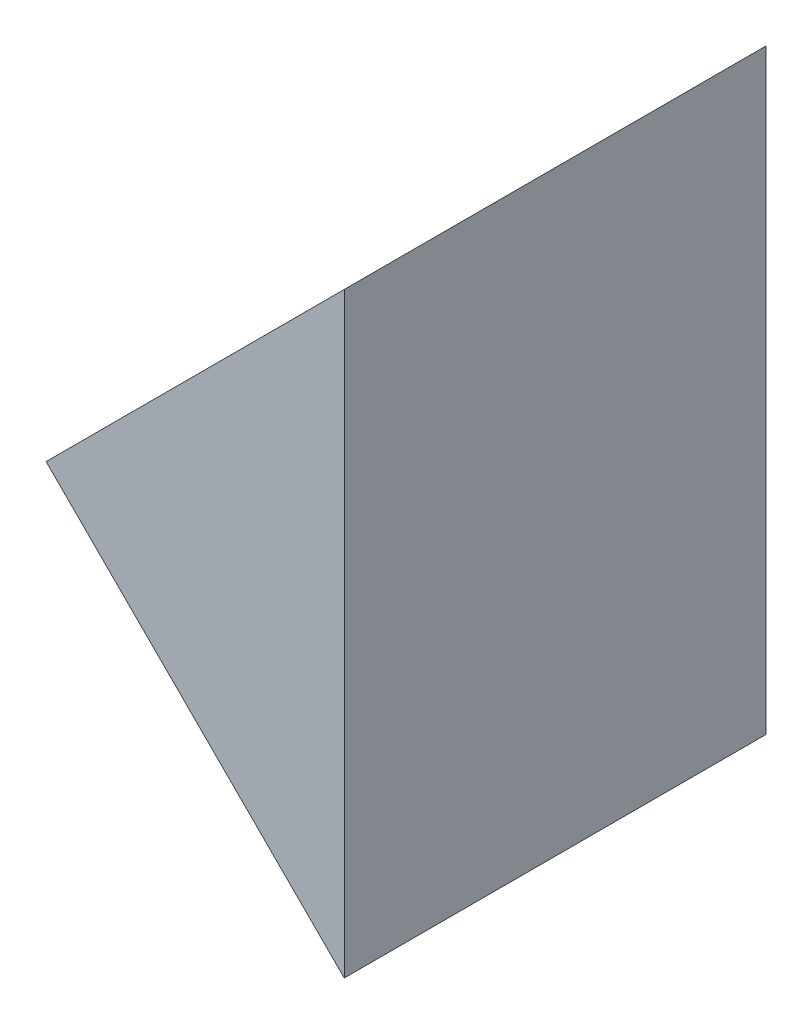
ISO-10303-21;
HEADER;
FILE_DESCRIPTION(('STEP AP214'),'2;1');
FILE_NAME('part.step','',(''),(''),'','','');
FILE_SCHEMA(('AUTOMOTIVE_DESIGN { 1 0 10303 214 1 1 1 1 }'));
ENDSEC;
DATA;
#1=APPLICATION_CONTEXT('core data for automotive mechanical design processes');
#2=APPLICATION_PROTOCOL_DEFINITION('international standard','automotive_design',2000,#1);
#3=PRODUCT_CONTEXT('',#1,'mechanical');
#4=PRODUCT('Part','Part','',(#3));
#5=PRODUCT_RELATED_PRODUCT_CATEGORY('part','',(#4));
#6=PRODUCT_DEFINITION_FORMATION('','',#4);
#7=PRODUCT_DEFINITION_CONTEXT('part definition',#1,'design');
#8=PRODUCT_DEFINITION('design','',#6,#7);
#9=PRODUCT_DEFINITION_SHAPE('','',#8);
#10=(LENGTH_UNIT() NAMED_UNIT(*) SI_UNIT(.MILLI.,.METRE.));
#11=(NAMED_UNIT(*) PLANE_ANGLE_UNIT() SI_UNIT($,.RADIAN.));
#12=(NAMED_UNIT(*) SI_UNIT($,.STERADIAN.) SOLID_ANGLE_UNIT());
#13=UNCERTAINTY_MEASURE_WITH_UNIT(LENGTH_MEASURE(1.E-05),#10,'distance_accuracy_value','');
#14=(GEOMETRIC_REPRESENTATION_CONTEXT(3) GLOBAL_UNCERTAINTY_ASSIGNED_CONTEXT((#13)) GLOBAL_UNIT_ASSIGNED_CONTEXT((#10,
#11,#12)) REPRESENTATION_CONTEXT('',''));
#15=CARTESIAN_POINT('',(0.,0.,0.));
#16=DIRECTION('',(0.,0.,1.));
#17=DIRECTION('',(1.,0.,0.));
#18=AXIS2_PLACEMENT_3D('',#15,#16,#17);
#19=CARTESIAN_POINT('',(196.707346195092,31.7768393825968,20.));
#20=DIRECTION('',(-1.,0.,0.));
#21=DIRECTION('',(0.,0.,1.));
#22=AXIS2_PLACEMENT_3D('',#19,#20,#21);
#23=PLANE('',#22);
#24=DIRECTION('',(0.,1.,0.));
#25=VECTOR('',#24,1.);
#26=CARTESIAN_POINT('',(196.707346195092,31.7768393825968,0.));
#27=LINE('',#26,#25);
#28=CARTESIAN_POINT('',(196.707346195092,31.7768393825968,0.));
#29=VERTEX_POINT('',#28);
#30=CARTESIAN_POINT('',(196.707346195092,60.0611106300587,0.));
#31=VERTEX_POINT('',#30);
#32=EDGE_CURVE('E84',#29,#31,#27,.T.);
#33=ORIENTED_EDGE('',*,*,#32,.T.);
#34=DIRECTION('',(0.,0.,-1.));
#35=VECTOR('',#34,1.);
#36=CARTESIAN_POINT('',(196.707346195092,60.0611106300587,20.));
#37=LINE('',#36,#35);
#38=CARTESIAN_POINT('',(196.707346195092,60.0611106300587,20.));
#39=VERTEX_POINT('',#38);
#40=EDGE_CURVE('E11',#39,#31,#37,.T.);
#41=ORIENTED_EDGE('',*,*,#40,.F.);
#42=DIRECTION('',(0.,1.,0.));
#43=VECTOR('',#42,1.);
#44=CARTESIAN_POINT('',(196.707346195092,31.7768393825968,20.));
#45=LINE('',#44,#43);
#46=CARTESIAN_POINT('',(196.707346195092,31.7768393825968,20.));
#47=VERTEX_POINT('',#46);
#48=EDGE_CURVE('E77',#47,#39,#45,.T.);
#49=ORIENTED_EDGE('',*,*,#48,.F.);
#50=DIRECTION('',(0.,0.,-1.));
#51=VECTOR('',#50,1.);
#52=CARTESIAN_POINT('',(196.707346195092,31.7768393825968,20.));
#53=LINE('',#52,#51);
#54=EDGE_CURVE('E85',#47,#29,#53,.T.);
#55=ORIENTED_EDGE('',*,*,#54,.T.);
#56=EDGE_LOOP('',(#33,#41,#49,#55));
#57=FACE_BOUND('',#56,.T.);
#58=ADVANCED_FACE('F37',(#57),#23,.F.);
#59=CARTESIAN_POINT('',(196.707346195092,60.0611106300587,20.));
#60=DIRECTION('',(0.707106781186546,-0.707106781186549,0.));
#61=DIRECTION('',(0.707106781186549,0.707106781186546,0.));
#62=AXIS2_PLACEMENT_3D('',#59,#60,#61);
#63=PLANE('',#62);
#64=DIRECTION('',(-0.707106781186549,-0.707106781186546,0.));
#65=VECTOR('',#64,1.);
#66=CARTESIAN_POINT('',(196.707346195092,60.0611106300587,0.));
#67=LINE('',#66,#65);
#68=CARTESIAN_POINT('',(182.565210571361,45.9189750063278,0.));
#69=VERTEX_POINT('',#68);
#70=EDGE_CURVE('E65',#31,#69,#67,.T.);
#71=ORIENTED_EDGE('',*,*,#70,.T.);
#72=DIRECTION('',(0.,0.,-1.));
#73=VECTOR('',#72,1.);
#74=CARTESIAN_POINT('',(182.565210571361,45.9189750063278,20.));
#75=LINE('',#74,#73);
#76=CARTESIAN_POINT('',(182.565210571361,45.9189750063278,20.));
#77=VERTEX_POINT('',#76);
#78=EDGE_CURVE('E45',#77,#69,#75,.T.);
#79=ORIENTED_EDGE('',*,*,#78,.F.);
#80=DIRECTION('',(-0.707106781186549,-0.707106781186546,0.));
#81=VECTOR('',#80,1.);
#82=CARTESIAN_POINT('',(196.707346195092,60.0611106300587,20.));
#83=LINE('',#82,#81);
#84=EDGE_CURVE('E73',#39,#77,#83,.T.);
#85=ORIENTED_EDGE('',*,*,#84,.F.);
#86=ORIENTED_EDGE('',*,*,#40,.T.);
#87=EDGE_LOOP('',(#71,#79,#85,#86));
#88=FACE_BOUND('',#87,.T.);
#89=ADVANCED_FACE('F74',(#88),#63,.F.);
#90=CARTESIAN_POINT('',(182.565210571361,45.9189750063278,20.));
#91=DIRECTION('',(0.707106781186547,0.707106781186548,0.));
#92=DIRECTION('',(-0.707106781186548,0.707106781186547,0.));
#93=AXIS2_PLACEMENT_3D('',#90,#91,#92);
#94=PLANE('',#93);
#95=DIRECTION('',(0.707106781186548,-0.707106781186547,0.));
#96=VECTOR('',#95,1.);
#97=CARTESIAN_POINT('',(182.565210571361,45.9189750063278,0.));
#98=LINE('',#97,#96);
#99=EDGE_CURVE('E70',#69,#29,#98,.T.);
#100=ORIENTED_EDGE('',*,*,#99,.T.);
#101=ORIENTED_EDGE('',*,*,#54,.F.);
#102=DIRECTION('',(0.707106781186548,-0.707106781186547,0.));
#103=VECTOR('',#102,1.);
#104=CARTESIAN_POINT('',(182.565210571361,45.9189750063278,20.));
#105=LINE('',#104,#103);
#106=EDGE_CURVE('E53',#77,#47,#105,.T.);
#107=ORIENTED_EDGE('',*,*,#106,.F.);
#108=ORIENTED_EDGE('',*,*,#78,.T.);
#109=EDGE_LOOP('',(#100,#101,#107,#108));
#110=FACE_BOUND('',#109,.T.);
#111=ADVANCED_FACE('F92',(#110),#94,.F.);
#112=CARTESIAN_POINT('',(0.,0.,20.));
#113=DIRECTION('',(0.,0.,1.));
#114=DIRECTION('',(1.,0.,0.));
#115=AXIS2_PLACEMENT_3D('',#112,#113,#114);
#116=PLANE('',#115);
#117=ORIENTED_EDGE('',*,*,#48,.T.);
#118=ORIENTED_EDGE('',*,*,#84,.T.);
#119=ORIENTED_EDGE('',*,*,#106,.T.);
#120=EDGE_LOOP('',(#117,#118,#119));
#121=FACE_BOUND('',#120,.T.);
#122=ADVANCED_FACE('F80',(#121),#116,.T.);
#123=CARTESIAN_POINT('',(0.,0.,0.));
#124=DIRECTION('',(0.,0.,1.));
#125=DIRECTION('',(1.,0.,0.));
#126=AXIS2_PLACEMENT_3D('',#123,#124,#125);
#127=PLANE('',#126);
#128=ORIENTED_EDGE('',*,*,#32,.F.);
#129=ORIENTED_EDGE('',*,*,#99,.F.);
#130=ORIENTED_EDGE('',*,*,#70,.F.);
#131=EDGE_LOOP('',(#128,#129,#130));
#132=FACE_BOUND('',#131,.T.);
#133=ADVANCED_FACE('F93',(#132),#127,.F.);
#134=CLOSED_SHELL('',(#58,#89,#111,#122,#133));
#135=MANIFOLD_SOLID_BREP('B2',#134);
#136=ADVANCED_BREP_SHAPE_REPRESENTATION('',(#18,#135),#14);
#137=SHAPE_DEFINITION_REPRESENTATION(#9,#136);
ENDSEC;
END-ISO-10303-21;
